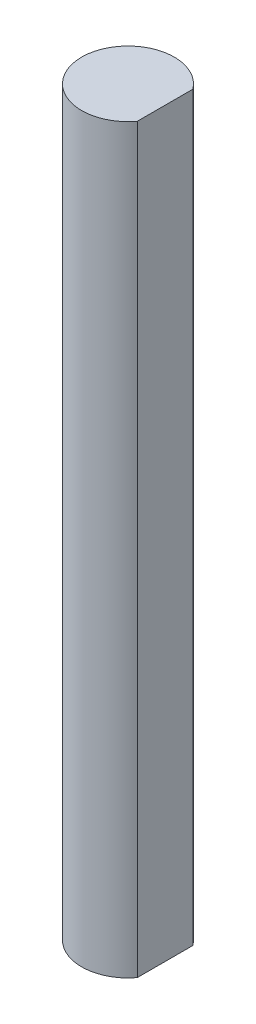
ISO-10303-21;
HEADER;
FILE_DESCRIPTION(('STEP AP214'),'2;1');
FILE_NAME('part.step','',(''),(''),'','','');
FILE_SCHEMA(('AUTOMOTIVE_DESIGN { 1 0 10303 214 1 1 1 1 }'));
ENDSEC;
DATA;
#1=APPLICATION_CONTEXT('core data for automotive mechanical design processes');
#2=APPLICATION_PROTOCOL_DEFINITION('international standard','automotive_design',2000,#1);
#3=PRODUCT_CONTEXT('',#1,'mechanical');
#4=PRODUCT('Part','Part','',(#3));
#5=PRODUCT_RELATED_PRODUCT_CATEGORY('part','',(#4));
#6=PRODUCT_DEFINITION_FORMATION('','',#4);
#7=PRODUCT_DEFINITION_CONTEXT('part definition',#1,'design');
#8=PRODUCT_DEFINITION('design','',#6,#7);
#9=PRODUCT_DEFINITION_SHAPE('','',#8);
#10=(LENGTH_UNIT() NAMED_UNIT(*) SI_UNIT(.MILLI.,.METRE.));
#11=(NAMED_UNIT(*) PLANE_ANGLE_UNIT() SI_UNIT($,.RADIAN.));
#12=(NAMED_UNIT(*) SI_UNIT($,.STERADIAN.) SOLID_ANGLE_UNIT());
#13=UNCERTAINTY_MEASURE_WITH_UNIT(LENGTH_MEASURE(1.E-05),#10,'distance_accuracy_value','');
#14=(GEOMETRIC_REPRESENTATION_CONTEXT(3) GLOBAL_UNCERTAINTY_ASSIGNED_CONTEXT((#13)) GLOBAL_UNIT_ASSIGNED_CONTEXT((#10,
#11,#12)) REPRESENTATION_CONTEXT('',''));
#15=CARTESIAN_POINT('',(0.,0.,0.));
#16=DIRECTION('',(0.,0.,1.));
#17=DIRECTION('',(1.,0.,0.));
#18=AXIS2_PLACEMENT_3D('',#15,#16,#17);
#19=CARTESIAN_POINT('',(0.,50.8,0.));
#20=DIRECTION('',(0.,-1.,0.));
#21=DIRECTION('',(0.,0.,-1.));
#22=AXIS2_PLACEMENT_3D('',#19,#20,#21);
#23=CYLINDRICAL_SURFACE('',#22,3.175);
#24=CARTESIAN_POINT('',(0.,0.,0.));
#25=DIRECTION('',(0.,1.,0.));
#26=DIRECTION('',(0.,0.,1.));
#27=AXIS2_PLACEMENT_3D('',#24,#25,#26);
#28=CIRCLE('',#27,3.175);
#29=CARTESIAN_POINT('',(2.54,0.,-1.905));
#30=VERTEX_POINT('',#29);
#31=CARTESIAN_POINT('',(2.54,0.,1.905));
#32=VERTEX_POINT('',#31);
#33=EDGE_CURVE('E58',#30,#32,#28,.T.);
#34=ORIENTED_EDGE('',*,*,#33,.T.);
#35=DIRECTION('',(0.,-1.,0.));
#36=VECTOR('',#35,1.);
#37=CARTESIAN_POINT('',(2.54,50.8,1.905));
#38=LINE('',#37,#36);
#39=CARTESIAN_POINT('',(2.54,50.8,1.905));
#40=VERTEX_POINT('',#39);
#41=EDGE_CURVE('E11',#40,#32,#38,.T.);
#42=ORIENTED_EDGE('',*,*,#41,.F.);
#43=CARTESIAN_POINT('',(0.,50.8,0.));
#44=DIRECTION('',(0.,1.,0.));
#45=DIRECTION('',(0.,0.,1.));
#46=AXIS2_PLACEMENT_3D('',#43,#44,#45);
#47=CIRCLE('',#46,3.175);
#48=CARTESIAN_POINT('',(2.54,50.8,-1.905));
#49=VERTEX_POINT('',#48);
#50=EDGE_CURVE('E60',#49,#40,#47,.T.);
#51=ORIENTED_EDGE('',*,*,#50,.F.);
#52=DIRECTION('',(0.,-1.,0.));
#53=VECTOR('',#52,1.);
#54=CARTESIAN_POINT('',(2.54,50.8,-1.905));
#55=LINE('',#54,#53);
#56=EDGE_CURVE('E42',#49,#30,#55,.T.);
#57=ORIENTED_EDGE('',*,*,#56,.T.);
#58=EDGE_LOOP('',(#34,#42,#51,#57));
#59=FACE_BOUND('',#58,.T.);
#60=ADVANCED_FACE('F34',(#59),#23,.T.);
#61=CARTESIAN_POINT('',(2.54,50.8,0.));
#62=DIRECTION('',(1.,0.,0.));
#63=DIRECTION('',(0.,0.,-1.));
#64=AXIS2_PLACEMENT_3D('',#61,#62,#63);
#65=PLANE('',#64);
#66=DIRECTION('',(0.,0.,1.));
#67=VECTOR('',#66,1.);
#68=CARTESIAN_POINT('',(2.54,0.,0.));
#69=LINE('',#68,#67);
#70=EDGE_CURVE('E65',#30,#32,#69,.T.);
#71=ORIENTED_EDGE('',*,*,#70,.F.);
#72=ORIENTED_EDGE('',*,*,#56,.F.);
#73=DIRECTION('',(0.,0.,1.));
#74=VECTOR('',#73,1.);
#75=CARTESIAN_POINT('',(2.54,50.8,0.));
#76=LINE('',#75,#74);
#77=EDGE_CURVE('E62',#49,#40,#76,.T.);
#78=ORIENTED_EDGE('',*,*,#77,.T.);
#79=ORIENTED_EDGE('',*,*,#41,.T.);
#80=EDGE_LOOP('',(#71,#72,#78,#79));
#81=FACE_BOUND('',#80,.T.);
#82=ADVANCED_FACE('F67',(#81),#65,.T.);
#83=CARTESIAN_POINT('',(0.,50.8,0.));
#84=DIRECTION('',(0.,1.,0.));
#85=DIRECTION('',(0.,0.,1.));
#86=AXIS2_PLACEMENT_3D('',#83,#84,#85);
#87=PLANE('',#86);
#88=ORIENTED_EDGE('',*,*,#50,.T.);
#89=ORIENTED_EDGE('',*,*,#77,.F.);
#90=EDGE_LOOP('',(#88,#89));
#91=FACE_BOUND('',#90,.T.);
#92=ADVANCED_FACE('F72',(#91),#87,.T.);
#93=CARTESIAN_POINT('',(0.,0.,0.));
#94=DIRECTION('',(0.,1.,0.));
#95=DIRECTION('',(0.,0.,1.));
#96=AXIS2_PLACEMENT_3D('',#93,#94,#95);
#97=PLANE('',#96);
#98=ORIENTED_EDGE('',*,*,#33,.F.);
#99=ORIENTED_EDGE('',*,*,#70,.T.);
#100=EDGE_LOOP('',(#98,#99));
#101=FACE_BOUND('',#100,.T.);
#102=ADVANCED_FACE('F64',(#101),#97,.F.);
#103=CLOSED_SHELL('',(#60,#82,#92,#102));
#104=MANIFOLD_SOLID_BREP('B2',#103);
#105=ADVANCED_BREP_SHAPE_REPRESENTATION('',(#18,#104),#14);
#106=SHAPE_DEFINITION_REPRESENTATION(#9,#105);
ENDSEC;
END-ISO-10303-21;
